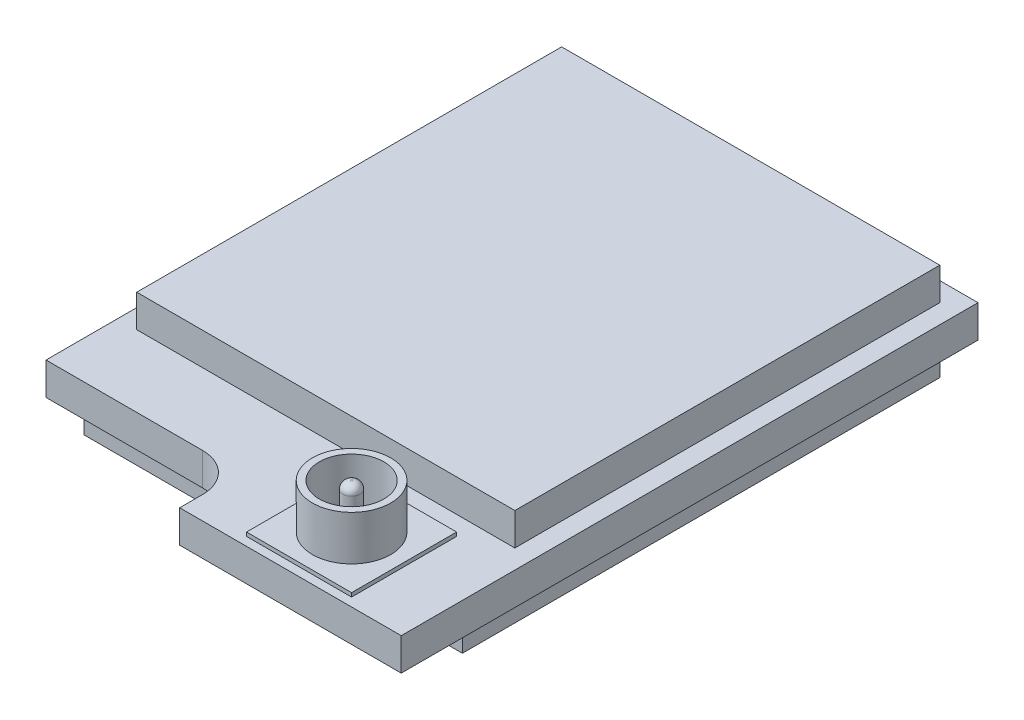
ISO-10303-21;
HEADER;
FILE_DESCRIPTION(('STEP AP214'),'2;1');
FILE_NAME('part.step','',(''),(''),'','','');
FILE_SCHEMA(('AUTOMOTIVE_DESIGN { 1 0 10303 214 1 1 1 1 }'));
ENDSEC;
DATA;
#1=APPLICATION_CONTEXT('core data for automotive mechanical design processes');
#2=APPLICATION_PROTOCOL_DEFINITION('international standard','automotive_design',2000,#1);
#3=PRODUCT_CONTEXT('',#1,'mechanical');
#4=PRODUCT('Part','Part','',(#3));
#5=PRODUCT_RELATED_PRODUCT_CATEGORY('part','',(#4));
#6=PRODUCT_DEFINITION_FORMATION('','',#4);
#7=PRODUCT_DEFINITION_CONTEXT('part definition',#1,'design');
#8=PRODUCT_DEFINITION('design','',#6,#7);
#9=PRODUCT_DEFINITION_SHAPE('','',#8);
#10=(LENGTH_UNIT() NAMED_UNIT(*) SI_UNIT(.MILLI.,.METRE.));
#11=(NAMED_UNIT(*) PLANE_ANGLE_UNIT() SI_UNIT($,.RADIAN.));
#12=(NAMED_UNIT(*) SI_UNIT($,.STERADIAN.) SOLID_ANGLE_UNIT());
#13=UNCERTAINTY_MEASURE_WITH_UNIT(LENGTH_MEASURE(1.E-05),#10,'distance_accuracy_value','');
#14=(GEOMETRIC_REPRESENTATION_CONTEXT(3) GLOBAL_UNCERTAINTY_ASSIGNED_CONTEXT((#13)) GLOBAL_UNIT_ASSIGNED_CONTEXT((#10,
#11,#12)) REPRESENTATION_CONTEXT('',''));
#15=CARTESIAN_POINT('',(0.,0.,0.));
#16=DIRECTION('',(0.,0.,1.));
#17=DIRECTION('',(1.,0.,0.));
#18=AXIS2_PLACEMENT_3D('',#15,#16,#17);
#19=CARTESIAN_POINT('',(-1.35,-0.425,7.75));
#20=DIRECTION('',(0.,-1.,0.));
#21=DIRECTION('',(0.,0.,-1.));
#22=AXIS2_PLACEMENT_3D('',#19,#20,#21);
#23=PLANE('',#22);
#24=DIRECTION('',(0.,0.,1.));
#25=VECTOR('',#24,1.);
#26=CARTESIAN_POINT('',(-5.45,-0.425,6.75));
#27=LINE('',#26,#25);
#28=CARTESIAN_POINT('',(-5.45,-0.425,-6.75));
#29=VERTEX_POINT('',#28);
#30=CARTESIAN_POINT('',(-5.45,-0.425,6.75));
#31=VERTEX_POINT('',#30);
#32=EDGE_CURVE('E272',#29,#31,#27,.T.);
#33=ORIENTED_EDGE('',*,*,#32,.F.);
#34=DIRECTION('',(-1.,0.,0.));
#35=VECTOR('',#34,1.);
#36=CARTESIAN_POINT('',(5.45,-0.425,-6.75));
#37=LINE('',#36,#35);
#38=CARTESIAN_POINT('',(5.45,-0.425,-6.75));
#39=VERTEX_POINT('',#38);
#40=EDGE_CURVE('E277',#39,#29,#37,.T.);
#41=ORIENTED_EDGE('',*,*,#40,.F.);
#42=DIRECTION('',(0.,0.,-1.));
#43=VECTOR('',#42,1.);
#44=CARTESIAN_POINT('',(5.45,-0.425,6.75));
#45=LINE('',#44,#43);
#46=CARTESIAN_POINT('',(5.45,-0.425,8.35));
#47=VERTEX_POINT('',#46);
#48=EDGE_CURVE('E301',#47,#39,#45,.T.);
#49=ORIENTED_EDGE('',*,*,#48,.F.);
#50=DIRECTION('',(1.,0.,0.));
#51=VECTOR('',#50,1.);
#52=CARTESIAN_POINT('',(-0.349999999999999,-0.425,8.35));
#53=LINE('',#52,#51);
#54=CARTESIAN_POINT('',(-0.349999999999999,-0.425,8.35));
#55=VERTEX_POINT('',#54);
#56=EDGE_CURVE('E298',#55,#47,#53,.T.);
#57=ORIENTED_EDGE('',*,*,#56,.F.);
#58=DIRECTION('',(0.,0.,1.));
#59=VECTOR('',#58,1.);
#60=CARTESIAN_POINT('',(-0.349999999999999,-0.425,7.75000000000001));
#61=LINE('',#60,#59);
#62=CARTESIAN_POINT('',(-0.349999999999999,-0.425,7.75000000000001));
#63=VERTEX_POINT('',#62);
#64=EDGE_CURVE('E296',#63,#55,#61,.T.);
#65=ORIENTED_EDGE('',*,*,#64,.F.);
#66=CARTESIAN_POINT('',(-1.35,-0.425,7.75));
#67=DIRECTION('',(0.,-1.,0.));
#68=DIRECTION('',(0.,0.,-1.));
#69=AXIS2_PLACEMENT_3D('',#66,#67,#68);
#70=CIRCLE('',#69,1.);
#71=CARTESIAN_POINT('',(-1.35000000000001,-0.425,6.75));
#72=VERTEX_POINT('',#71);
#73=EDGE_CURVE('E294',#72,#63,#70,.T.);
#74=ORIENTED_EDGE('',*,*,#73,.F.);
#75=DIRECTION('',(1.,0.,0.));
#76=VECTOR('',#75,1.);
#77=CARTESIAN_POINT('',(-5.45,-0.425,6.75));
#78=LINE('',#77,#76);
#79=EDGE_CURVE('E292',#31,#72,#78,.T.);
#80=ORIENTED_EDGE('',*,*,#79,.F.);
#81=EDGE_LOOP('',(#33,#41,#49,#57,#65,#74,#80));
#82=FACE_BOUND('',#81,.T.);
#83=DIRECTION('',(1.,0.,0.));
#84=VECTOR('',#83,1.);
#85=CARTESIAN_POINT('',(-1.35,-0.425,6.25));
#86=LINE('',#85,#84);
#87=CARTESIAN_POINT('',(-4.95,-0.425,6.25));
#88=VERTEX_POINT('',#87);
#89=CARTESIAN_POINT('',(4.95,-0.425,6.25));
#90=VERTEX_POINT('',#89);
#91=EDGE_CURVE('E343',#88,#90,#86,.T.);
#92=ORIENTED_EDGE('',*,*,#91,.T.);
#93=DIRECTION('',(0.,0.,-1.));
#94=VECTOR('',#93,1.);
#95=CARTESIAN_POINT('',(4.95,-0.425,7.75));
#96=LINE('',#95,#94);
#97=CARTESIAN_POINT('',(4.95,-0.425,-6.25));
#98=VERTEX_POINT('',#97);
#99=EDGE_CURVE('E346',#90,#98,#96,.T.);
#100=ORIENTED_EDGE('',*,*,#99,.T.);
#101=DIRECTION('',(-1.,0.,0.));
#102=VECTOR('',#101,1.);
#103=CARTESIAN_POINT('',(-1.35,-0.425,-6.25));
#104=LINE('',#103,#102);
#105=CARTESIAN_POINT('',(-4.95,-0.425,-6.25));
#106=VERTEX_POINT('',#105);
#107=EDGE_CURVE('E338',#98,#106,#104,.T.);
#108=ORIENTED_EDGE('',*,*,#107,.T.);
#109=DIRECTION('',(0.,0.,1.));
#110=VECTOR('',#109,1.);
#111=CARTESIAN_POINT('',(-4.95,-0.425,7.75));
#112=LINE('',#111,#110);
#113=EDGE_CURVE('E341',#106,#88,#112,.T.);
#114=ORIENTED_EDGE('',*,*,#113,.T.);
#115=EDGE_LOOP('',(#92,#100,#108,#114));
#116=FACE_BOUND('',#115,.T.);
#117=ADVANCED_FACE('F52',(#82,#116),#23,.T.);
#118=CARTESIAN_POINT('',(-1.35,0.425,7.75));
#119=DIRECTION('',(0.,-1.,0.));
#120=DIRECTION('',(0.,0.,-1.));
#121=AXIS2_PLACEMENT_3D('',#118,#119,#120);
#122=PLANE('',#121);
#123=DIRECTION('',(1.,0.,0.));
#124=VECTOR('',#123,1.);
#125=CARTESIAN_POINT('',(-1.35,0.425,-6.25));
#126=LINE('',#125,#124);
#127=CARTESIAN_POINT('',(-4.95,0.425,-6.25));
#128=VERTEX_POINT('',#127);
#129=CARTESIAN_POINT('',(4.95,0.425,-6.25));
#130=VERTEX_POINT('',#129);
#131=EDGE_CURVE('E60',#128,#130,#126,.T.);
#132=ORIENTED_EDGE('',*,*,#131,.T.);
#133=DIRECTION('',(0.,0.,1.));
#134=VECTOR('',#133,1.);
#135=CARTESIAN_POINT('',(4.95,0.425,7.75));
#136=LINE('',#135,#134);
#137=CARTESIAN_POINT('',(4.95,0.425,4.875));
#138=VERTEX_POINT('',#137);
#139=EDGE_CURVE('E12',#130,#138,#136,.T.);
#140=ORIENTED_EDGE('',*,*,#139,.T.);
#141=DIRECTION('',(-1.,0.,0.));
#142=VECTOR('',#141,1.);
#143=CARTESIAN_POINT('',(-1.35,0.425,4.875));
#144=LINE('',#143,#142);
#145=CARTESIAN_POINT('',(-4.95,0.425,4.875));
#146=VERTEX_POINT('',#145);
#147=EDGE_CURVE('E188',#138,#146,#144,.T.);
#148=ORIENTED_EDGE('',*,*,#147,.T.);
#149=DIRECTION('',(0.,0.,-1.));
#150=VECTOR('',#149,1.);
#151=CARTESIAN_POINT('',(-4.95,0.425,7.75));
#152=LINE('',#151,#150);
#153=EDGE_CURVE('E349',#146,#128,#152,.T.);
#154=ORIENTED_EDGE('',*,*,#153,.T.);
#155=EDGE_LOOP('',(#132,#140,#148,#154));
#156=FACE_BOUND('',#155,.T.);
#157=DIRECTION('',(1.,0.,0.));
#158=VECTOR('',#157,1.);
#159=CARTESIAN_POINT('',(1.175,0.425,8.125));
#160=LINE('',#159,#158);
#161=CARTESIAN_POINT('',(1.175,0.425,8.125));
#162=VERTEX_POINT('',#161);
#163=CARTESIAN_POINT('',(3.925,0.425,8.125));
#164=VERTEX_POINT('',#163);
#165=EDGE_CURVE('E254',#162,#164,#160,.T.);
#166=ORIENTED_EDGE('',*,*,#165,.F.);
#167=DIRECTION('',(0.,0.,1.));
#168=VECTOR('',#167,1.);
#169=CARTESIAN_POINT('',(1.175,0.425,5.375));
#170=LINE('',#169,#168);
#171=CARTESIAN_POINT('',(1.175,0.425,5.375));
#172=VERTEX_POINT('',#171);
#173=EDGE_CURVE('E252',#172,#162,#170,.T.);
#174=ORIENTED_EDGE('',*,*,#173,.F.);
#175=DIRECTION('',(-1.,0.,0.));
#176=VECTOR('',#175,1.);
#177=CARTESIAN_POINT('',(1.175,0.425,5.375));
#178=LINE('',#177,#176);
#179=CARTESIAN_POINT('',(3.925,0.425,5.375));
#180=VERTEX_POINT('',#179);
#181=EDGE_CURVE('E245',#180,#172,#178,.T.);
#182=ORIENTED_EDGE('',*,*,#181,.F.);
#183=DIRECTION('',(0.,0.,-1.));
#184=VECTOR('',#183,1.);
#185=CARTESIAN_POINT('',(3.925,0.425,5.375));
#186=LINE('',#185,#184);
#187=EDGE_CURVE('E257',#164,#180,#186,.T.);
#188=ORIENTED_EDGE('',*,*,#187,.F.);
#189=EDGE_LOOP('',(#166,#174,#182,#188));
#190=FACE_BOUND('',#189,.T.);
#191=DIRECTION('',(0.,0.,1.));
#192=VECTOR('',#191,1.);
#193=CARTESIAN_POINT('',(-5.45,0.425,6.75));
#194=LINE('',#193,#192);
#195=CARTESIAN_POINT('',(-5.45,0.425,-6.75));
#196=VERTEX_POINT('',#195);
#197=CARTESIAN_POINT('',(-5.45,0.425,6.75));
#198=VERTEX_POINT('',#197);
#199=EDGE_CURVE('E273',#196,#198,#194,.T.);
#200=ORIENTED_EDGE('',*,*,#199,.T.);
#201=DIRECTION('',(1.,0.,0.));
#202=VECTOR('',#201,1.);
#203=CARTESIAN_POINT('',(-5.45,0.425,6.75));
#204=LINE('',#203,#202);
#205=CARTESIAN_POINT('',(-1.35000000000001,0.425,6.75));
#206=VERTEX_POINT('',#205);
#207=EDGE_CURVE('E276',#198,#206,#204,.T.);
#208=ORIENTED_EDGE('',*,*,#207,.T.);
#209=CARTESIAN_POINT('',(-1.35,0.425,7.75));
#210=DIRECTION('',(0.,-1.,0.));
#211=DIRECTION('',(0.,0.,-1.));
#212=AXIS2_PLACEMENT_3D('',#209,#210,#211);
#213=CIRCLE('',#212,1.);
#214=CARTESIAN_POINT('',(-0.349999999999999,0.425,7.75000000000001));
#215=VERTEX_POINT('',#214);
#216=EDGE_CURVE('E279',#206,#215,#213,.T.);
#217=ORIENTED_EDGE('',*,*,#216,.T.);
#218=DIRECTION('',(0.,0.,1.));
#219=VECTOR('',#218,1.);
#220=CARTESIAN_POINT('',(-0.349999999999999,0.425,7.75000000000001));
#221=LINE('',#220,#219);
#222=CARTESIAN_POINT('',(-0.349999999999999,0.425,8.35));
#223=VERTEX_POINT('',#222);
#224=EDGE_CURVE('E281',#215,#223,#221,.T.);
#225=ORIENTED_EDGE('',*,*,#224,.T.);
#226=DIRECTION('',(1.,0.,0.));
#227=VECTOR('',#226,1.);
#228=CARTESIAN_POINT('',(-0.349999999999999,0.425,8.35));
#229=LINE('',#228,#227);
#230=CARTESIAN_POINT('',(5.45,0.425,8.35));
#231=VERTEX_POINT('',#230);
#232=EDGE_CURVE('E283',#223,#231,#229,.T.);
#233=ORIENTED_EDGE('',*,*,#232,.T.);
#234=DIRECTION('',(0.,0.,-1.));
#235=VECTOR('',#234,1.);
#236=CARTESIAN_POINT('',(5.45,0.425,8.35));
#237=LINE('',#236,#235);
#238=CARTESIAN_POINT('',(5.45,0.425,-6.75));
#239=VERTEX_POINT('',#238);
#240=EDGE_CURVE('E285',#231,#239,#237,.T.);
#241=ORIENTED_EDGE('',*,*,#240,.T.);
#242=DIRECTION('',(-1.,0.,0.));
#243=VECTOR('',#242,1.);
#244=CARTESIAN_POINT('',(5.45,0.425,-6.75));
#245=LINE('',#244,#243);
#246=EDGE_CURVE('E287',#239,#196,#245,.T.);
#247=ORIENTED_EDGE('',*,*,#246,.T.);
#248=EDGE_LOOP('',(#200,#208,#217,#225,#233,#241,#247));
#249=FACE_BOUND('',#248,.T.);
#250=ADVANCED_FACE('F353',(#156,#190,#249),#122,.F.);
#251=CARTESIAN_POINT('',(-5.45,0.425,6.75));
#252=DIRECTION('',(1.,0.,0.));
#253=DIRECTION('',(0.,0.,-1.));
#254=AXIS2_PLACEMENT_3D('',#251,#252,#253);
#255=PLANE('',#254);
#256=ORIENTED_EDGE('',*,*,#32,.T.);
#257=DIRECTION('',(0.,-1.,0.));
#258=VECTOR('',#257,1.);
#259=CARTESIAN_POINT('',(-5.45,0.425,6.75));
#260=LINE('',#259,#258);
#261=EDGE_CURVE('E321',#198,#31,#260,.T.);
#262=ORIENTED_EDGE('',*,*,#261,.F.);
#263=ORIENTED_EDGE('',*,*,#199,.F.);
#264=DIRECTION('',(0.,-1.,0.));
#265=VECTOR('',#264,1.);
#266=CARTESIAN_POINT('',(-5.45,0.425,-6.75));
#267=LINE('',#266,#265);
#268=EDGE_CURVE('E289',#196,#29,#267,.T.);
#269=ORIENTED_EDGE('',*,*,#268,.T.);
#270=EDGE_LOOP('',(#256,#262,#263,#269));
#271=FACE_BOUND('',#270,.T.);
#272=ADVANCED_FACE('F373',(#271),#255,.F.);
#273=CARTESIAN_POINT('',(-5.45,0.425,6.75));
#274=DIRECTION('',(0.,0.,-1.));
#275=DIRECTION('',(-1.,0.,0.));
#276=AXIS2_PLACEMENT_3D('',#273,#274,#275);
#277=PLANE('',#276);
#278=ORIENTED_EDGE('',*,*,#79,.T.);
#279=DIRECTION('',(0.,-1.,0.));
#280=VECTOR('',#279,1.);
#281=CARTESIAN_POINT('',(-1.35000000000001,0.425,6.75));
#282=LINE('',#281,#280);
#283=EDGE_CURVE('E318',#206,#72,#282,.T.);
#284=ORIENTED_EDGE('',*,*,#283,.F.);
#285=ORIENTED_EDGE('',*,*,#207,.F.);
#286=ORIENTED_EDGE('',*,*,#261,.T.);
#287=EDGE_LOOP('',(#278,#284,#285,#286));
#288=FACE_BOUND('',#287,.T.);
#289=ADVANCED_FACE('F399',(#288),#277,.F.);
#290=CARTESIAN_POINT('',(-1.35,0.425,7.75));
#291=DIRECTION('',(0.,-1.,0.));
#292=DIRECTION('',(0.,0.,-1.));
#293=AXIS2_PLACEMENT_3D('',#290,#291,#292);
#294=CYLINDRICAL_SURFACE('',#293,1.);
#295=ORIENTED_EDGE('',*,*,#73,.T.);
#296=DIRECTION('',(0.,-1.,0.));
#297=VECTOR('',#296,1.);
#298=CARTESIAN_POINT('',(-0.349999999999999,0.425,7.75000000000001));
#299=LINE('',#298,#297);
#300=EDGE_CURVE('E315',#215,#63,#299,.T.);
#301=ORIENTED_EDGE('',*,*,#300,.F.);
#302=ORIENTED_EDGE('',*,*,#216,.F.);
#303=ORIENTED_EDGE('',*,*,#283,.T.);
#304=EDGE_LOOP('',(#295,#301,#302,#303));
#305=FACE_BOUND('',#304,.T.);
#306=ADVANCED_FACE('F395',(#305),#294,.F.);
#307=CARTESIAN_POINT('',(-0.349999999999999,0.425,7.75000000000001));
#308=DIRECTION('',(1.,0.,0.));
#309=DIRECTION('',(0.,0.,-1.));
#310=AXIS2_PLACEMENT_3D('',#307,#308,#309);
#311=PLANE('',#310);
#312=ORIENTED_EDGE('',*,*,#64,.T.);
#313=DIRECTION('',(0.,-1.,0.));
#314=VECTOR('',#313,1.);
#315=CARTESIAN_POINT('',(-0.349999999999999,0.425,8.35));
#316=LINE('',#315,#314);
#317=EDGE_CURVE('E312',#223,#55,#316,.T.);
#318=ORIENTED_EDGE('',*,*,#317,.F.);
#319=ORIENTED_EDGE('',*,*,#224,.F.);
#320=ORIENTED_EDGE('',*,*,#300,.T.);
#321=EDGE_LOOP('',(#312,#318,#319,#320));
#322=FACE_BOUND('',#321,.T.);
#323=ADVANCED_FACE('F391',(#322),#311,.F.);
#324=CARTESIAN_POINT('',(-0.349999999999999,0.425,8.35));
#325=DIRECTION('',(0.,0.,-1.));
#326=DIRECTION('',(-1.,0.,0.));
#327=AXIS2_PLACEMENT_3D('',#324,#325,#326);
#328=PLANE('',#327);
#329=ORIENTED_EDGE('',*,*,#56,.T.);
#330=DIRECTION('',(0.,-1.,0.));
#331=VECTOR('',#330,1.);
#332=CARTESIAN_POINT('',(5.45,0.425,8.35));
#333=LINE('',#332,#331);
#334=EDGE_CURVE('E309',#231,#47,#333,.T.);
#335=ORIENTED_EDGE('',*,*,#334,.F.);
#336=ORIENTED_EDGE('',*,*,#232,.F.);
#337=ORIENTED_EDGE('',*,*,#317,.T.);
#338=EDGE_LOOP('',(#329,#335,#336,#337));
#339=FACE_BOUND('',#338,.T.);
#340=ADVANCED_FACE('F387',(#339),#328,.F.);
#341=CARTESIAN_POINT('',(5.45,0.425,6.75));
#342=DIRECTION('',(-1.,0.,0.));
#343=DIRECTION('',(0.,0.,1.));
#344=AXIS2_PLACEMENT_3D('',#341,#342,#343);
#345=PLANE('',#344);
#346=ORIENTED_EDGE('',*,*,#48,.T.);
#347=DIRECTION('',(0.,-1.,0.));
#348=VECTOR('',#347,1.);
#349=CARTESIAN_POINT('',(5.45,0.425,-6.75));
#350=LINE('',#349,#348);
#351=EDGE_CURVE('E306',#239,#39,#350,.T.);
#352=ORIENTED_EDGE('',*,*,#351,.F.);
#353=ORIENTED_EDGE('',*,*,#240,.F.);
#354=ORIENTED_EDGE('',*,*,#334,.T.);
#355=EDGE_LOOP('',(#346,#352,#353,#354));
#356=FACE_BOUND('',#355,.T.);
#357=ADVANCED_FACE('F383',(#356),#345,.F.);
#358=CARTESIAN_POINT('',(5.45,0.425,-6.75));
#359=DIRECTION('',(0.,0.,1.));
#360=DIRECTION('',(1.,0.,0.));
#361=AXIS2_PLACEMENT_3D('',#358,#359,#360);
#362=PLANE('',#361);
#363=ORIENTED_EDGE('',*,*,#40,.T.);
#364=ORIENTED_EDGE('',*,*,#268,.F.);
#365=ORIENTED_EDGE('',*,*,#246,.F.);
#366=ORIENTED_EDGE('',*,*,#351,.T.);
#367=EDGE_LOOP('',(#363,#364,#365,#366));
#368=FACE_BOUND('',#367,.T.);
#369=ADVANCED_FACE('F379',(#368),#362,.F.);
#370=CARTESIAN_POINT('',(1.175,0.525,5.375));
#371=DIRECTION('',(1.,0.,0.));
#372=DIRECTION('',(0.,0.,-1.));
#373=AXIS2_PLACEMENT_3D('',#370,#371,#372);
#374=PLANE('',#373);
#375=ORIENTED_EDGE('',*,*,#173,.T.);
#376=DIRECTION('',(0.,-1.,0.));
#377=VECTOR('',#376,1.);
#378=CARTESIAN_POINT('',(1.175,0.525,8.125));
#379=LINE('',#378,#377);
#380=CARTESIAN_POINT('',(1.175,0.525,8.125));
#381=VERTEX_POINT('',#380);
#382=EDGE_CURVE('E269',#381,#162,#379,.T.);
#383=ORIENTED_EDGE('',*,*,#382,.F.);
#384=DIRECTION('',(0.,0.,1.));
#385=VECTOR('',#384,1.);
#386=CARTESIAN_POINT('',(1.175,0.525,5.375));
#387=LINE('',#386,#385);
#388=CARTESIAN_POINT('',(1.175,0.525,5.375));
#389=VERTEX_POINT('',#388);
#390=EDGE_CURVE('E241',#389,#381,#387,.T.);
#391=ORIENTED_EDGE('',*,*,#390,.F.);
#392=DIRECTION('',(0.,-1.,0.));
#393=VECTOR('',#392,1.);
#394=CARTESIAN_POINT('',(1.175,0.525,5.375));
#395=LINE('',#394,#393);
#396=EDGE_CURVE('E251',#389,#172,#395,.T.);
#397=ORIENTED_EDGE('',*,*,#396,.T.);
#398=EDGE_LOOP('',(#375,#383,#391,#397));
#399=FACE_BOUND('',#398,.T.);
#400=ADVANCED_FACE('F382',(#399),#374,.F.);
#401=CARTESIAN_POINT('',(1.175,0.525,8.125));
#402=DIRECTION('',(0.,0.,-1.));
#403=DIRECTION('',(-1.,0.,0.));
#404=AXIS2_PLACEMENT_3D('',#401,#402,#403);
#405=PLANE('',#404);
#406=ORIENTED_EDGE('',*,*,#165,.T.);
#407=DIRECTION('',(0.,-1.,0.));
#408=VECTOR('',#407,1.);
#409=CARTESIAN_POINT('',(3.925,0.525,8.125));
#410=LINE('',#409,#408);
#411=CARTESIAN_POINT('',(3.925,0.525,8.125));
#412=VERTEX_POINT('',#411);
#413=EDGE_CURVE('E266',#412,#164,#410,.T.);
#414=ORIENTED_EDGE('',*,*,#413,.F.);
#415=DIRECTION('',(1.,0.,0.));
#416=VECTOR('',#415,1.);
#417=CARTESIAN_POINT('',(1.175,0.525,8.125));
#418=LINE('',#417,#416);
#419=EDGE_CURVE('E244',#381,#412,#418,.T.);
#420=ORIENTED_EDGE('',*,*,#419,.F.);
#421=ORIENTED_EDGE('',*,*,#382,.T.);
#422=EDGE_LOOP('',(#406,#414,#420,#421));
#423=FACE_BOUND('',#422,.T.);
#424=ADVANCED_FACE('F458',(#423),#405,.F.);
#425=CARTESIAN_POINT('',(3.925,0.525,5.375));
#426=DIRECTION('',(-1.,0.,0.));
#427=DIRECTION('',(0.,0.,1.));
#428=AXIS2_PLACEMENT_3D('',#425,#426,#427);
#429=PLANE('',#428);
#430=ORIENTED_EDGE('',*,*,#187,.T.);
#431=DIRECTION('',(0.,-1.,0.));
#432=VECTOR('',#431,1.);
#433=CARTESIAN_POINT('',(3.925,0.525,5.375));
#434=LINE('',#433,#432);
#435=CARTESIAN_POINT('',(3.925,0.525,5.375));
#436=VERTEX_POINT('',#435);
#437=EDGE_CURVE('E263',#436,#180,#434,.T.);
#438=ORIENTED_EDGE('',*,*,#437,.F.);
#439=DIRECTION('',(0.,0.,-1.));
#440=VECTOR('',#439,1.);
#441=CARTESIAN_POINT('',(3.925,0.525,5.375));
#442=LINE('',#441,#440);
#443=EDGE_CURVE('E247',#412,#436,#442,.T.);
#444=ORIENTED_EDGE('',*,*,#443,.F.);
#445=ORIENTED_EDGE('',*,*,#413,.T.);
#446=EDGE_LOOP('',(#430,#438,#444,#445));
#447=FACE_BOUND('',#446,.T.);
#448=ADVANCED_FACE('F466',(#447),#429,.F.);
#449=CARTESIAN_POINT('',(1.175,0.525,5.375));
#450=DIRECTION('',(0.,0.,1.));
#451=DIRECTION('',(1.,0.,0.));
#452=AXIS2_PLACEMENT_3D('',#449,#450,#451);
#453=PLANE('',#452);
#454=ORIENTED_EDGE('',*,*,#181,.T.);
#455=ORIENTED_EDGE('',*,*,#396,.F.);
#456=DIRECTION('',(-1.,0.,0.));
#457=VECTOR('',#456,1.);
#458=CARTESIAN_POINT('',(1.175,0.525,5.375));
#459=LINE('',#458,#457);
#460=EDGE_CURVE('E249',#436,#389,#459,.T.);
#461=ORIENTED_EDGE('',*,*,#460,.F.);
#462=ORIENTED_EDGE('',*,*,#437,.T.);
#463=EDGE_LOOP('',(#454,#455,#461,#462));
#464=FACE_BOUND('',#463,.T.);
#465=ADVANCED_FACE('F474',(#464),#453,.F.);
#466=CARTESIAN_POINT('',(0.,0.525,0.));
#467=DIRECTION('',(0.,1.,0.));
#468=DIRECTION('',(0.,0.,1.));
#469=AXIS2_PLACEMENT_3D('',#466,#467,#468);
#470=PLANE('',#469);
#471=CARTESIAN_POINT('',(2.55,0.525,6.75));
#472=DIRECTION('',(0.,1.,0.));
#473=DIRECTION('',(0.,0.,1.));
#474=AXIS2_PLACEMENT_3D('',#471,#472,#473);
#475=CIRCLE('',#474,1.025);
#476=CARTESIAN_POINT('',(2.55,0.525,7.775));
#477=VERTEX_POINT('',#476);
#478=EDGE_CURVE('E324',#477,#477,#475,.T.);
#479=ORIENTED_EDGE('',*,*,#478,.F.);
#480=EDGE_LOOP('',(#479));
#481=FACE_BOUND('',#480,.T.);
#482=ORIENTED_EDGE('',*,*,#390,.T.);
#483=ORIENTED_EDGE('',*,*,#419,.T.);
#484=ORIENTED_EDGE('',*,*,#443,.T.);
#485=ORIENTED_EDGE('',*,*,#460,.T.);
#486=EDGE_LOOP('',(#482,#483,#484,#485));
#487=FACE_BOUND('',#486,.T.);
#488=ADVANCED_FACE('F482',(#481,#487),#470,.T.);
#489=CARTESIAN_POINT('',(2.55,1.695,6.75));
#490=DIRECTION('',(0.,-1.,0.));
#491=DIRECTION('',(0.,0.,-1.));
#492=AXIS2_PLACEMENT_3D('',#489,#490,#491);
#493=CYLINDRICAL_SURFACE('',#492,1.025);
#494=ORIENTED_EDGE('',*,*,#478,.T.);
#495=EDGE_LOOP('',(#494));
#496=FACE_BOUND('',#495,.T.);
#497=CARTESIAN_POINT('',(2.55,1.695,6.75));
#498=DIRECTION('',(0.,-1.,0.));
#499=DIRECTION('',(0.,0.,-1.));
#500=AXIS2_PLACEMENT_3D('',#497,#498,#499);
#501=CIRCLE('',#500,1.025);
#502=CARTESIAN_POINT('',(2.55,1.695,5.725));
#503=VERTEX_POINT('',#502);
#504=EDGE_CURVE('E237',#503,#503,#501,.T.);
#505=ORIENTED_EDGE('',*,*,#504,.T.);
#506=EDGE_LOOP('',(#505));
#507=FACE_BOUND('',#506,.T.);
#508=ADVANCED_FACE('F490',(#496,#507),#493,.T.);
#509=CARTESIAN_POINT('',(2.55,1.695,6.75));
#510=DIRECTION('',(0.,-1.,0.));
#511=DIRECTION('',(0.,0.,-1.));
#512=AXIS2_PLACEMENT_3D('',#509,#510,#511);
#513=PLANE('',#512);
#514=CARTESIAN_POINT('',(2.55,1.695,6.75));
#515=DIRECTION('',(0.,-1.,0.));
#516=DIRECTION('',(0.,0.,-1.));
#517=AXIS2_PLACEMENT_3D('',#514,#515,#516);
#518=CIRCLE('',#517,0.845);
#519=CARTESIAN_POINT('',(2.55,1.695,5.905));
#520=VERTEX_POINT('',#519);
#521=EDGE_CURVE('E234',#520,#520,#518,.T.);
#522=ORIENTED_EDGE('',*,*,#521,.T.);
#523=EDGE_LOOP('',(#522));
#524=FACE_BOUND('',#523,.T.);
#525=ORIENTED_EDGE('',*,*,#504,.F.);
#526=EDGE_LOOP('',(#525));
#527=FACE_BOUND('',#526,.T.);
#528=ADVANCED_FACE('F499',(#524,#527),#513,.F.);
#529=CARTESIAN_POINT('',(2.55,1.695,6.75));
#530=DIRECTION('',(0.,-1.,0.));
#531=DIRECTION('',(0.,0.,-1.));
#532=AXIS2_PLACEMENT_3D('',#529,#530,#531);
#533=CYLINDRICAL_SURFACE('',#532,0.845);
#534=CARTESIAN_POINT('',(2.55,0.525,6.75));
#535=DIRECTION('',(0.,1.,0.));
#536=DIRECTION('',(0.,0.,1.));
#537=AXIS2_PLACEMENT_3D('',#534,#535,#536);
#538=CIRCLE('',#537,0.845);
#539=CARTESIAN_POINT('',(2.55,0.525,7.595));
#540=VERTEX_POINT('',#539);
#541=EDGE_CURVE('E240',#540,#540,#538,.T.);
#542=ORIENTED_EDGE('',*,*,#541,.F.);
#543=EDGE_LOOP('',(#542));
#544=FACE_BOUND('',#543,.T.);
#545=ORIENTED_EDGE('',*,*,#521,.F.);
#546=EDGE_LOOP('',(#545));
#547=FACE_BOUND('',#546,.T.);
#548=ADVANCED_FACE('F507',(#544,#547),#533,.F.);
#549=CARTESIAN_POINT('',(2.55,0.525,6.75));
#550=DIRECTION('',(0.,1.,0.));
#551=DIRECTION('',(0.,0.,1.));
#552=AXIS2_PLACEMENT_3D('',#549,#550,#551);
#553=CIRCLE('',#552,0.225);
#554=CARTESIAN_POINT('',(2.55,0.525,6.975));
#555=VERTEX_POINT('',#554);
#556=EDGE_CURVE('E329',#555,#555,#553,.T.);
#557=ORIENTED_EDGE('',*,*,#556,.F.);
#558=EDGE_LOOP('',(#557));
#559=FACE_BOUND('',#558,.T.);
#560=ORIENTED_EDGE('',*,*,#541,.T.);
#561=EDGE_LOOP('',(#560));
#562=FACE_BOUND('',#561,.T.);
#563=ADVANCED_FACE('F493',(#559,#562),#470,.T.);
#564=CARTESIAN_POINT('',(2.55,1.695,6.75));
#565=DIRECTION('',(0.,-1.,0.));
#566=DIRECTION('',(0.,0.,-1.));
#567=AXIS2_PLACEMENT_3D('',#564,#565,#566);
#568=CYLINDRICAL_SURFACE('',#567,0.225);
#569=CARTESIAN_POINT('',(2.55,1.495,6.75));
#570=DIRECTION('',(0.,-1.,0.));
#571=DIRECTION('',(0.,0.,-1.));
#572=AXIS2_PLACEMENT_3D('',#569,#570,#571);
#573=CIRCLE('',#572,0.225);
#574=CARTESIAN_POINT('',(2.55,1.495,6.525));
#575=VERTEX_POINT('',#574);
#576=EDGE_CURVE('E332',#575,#575,#573,.T.);
#577=ORIENTED_EDGE('',*,*,#576,.T.);
#578=EDGE_LOOP('',(#577));
#579=FACE_BOUND('',#578,.T.);
#580=ORIENTED_EDGE('',*,*,#556,.T.);
#581=EDGE_LOOP('',(#580));
#582=FACE_BOUND('',#581,.T.);
#583=ADVANCED_FACE('F522',(#579,#582),#568,.T.);
#584=CARTESIAN_POINT('',(2.55,1.695,6.75));
#585=DIRECTION('',(0.,-1.,0.));
#586=DIRECTION('',(0.,0.,-1.));
#587=AXIS2_PLACEMENT_3D('',#584,#585,#586);
#588=PLANE('',#587);
#589=CARTESIAN_POINT('',(2.55,1.695,6.75));
#590=DIRECTION('',(0.,-1.,0.));
#591=DIRECTION('',(0.,0.,-1.));
#592=AXIS2_PLACEMENT_3D('',#589,#590,#591);
#593=CIRCLE('',#592,0.0250000000000002);
#594=CARTESIAN_POINT('',(2.55,1.695,6.725));
#595=VERTEX_POINT('',#594);
#596=EDGE_CURVE('E335',#595,#595,#593,.F.);
#597=ORIENTED_EDGE('',*,*,#596,.T.);
#598=EDGE_LOOP('',(#597));
#599=FACE_BOUND('',#598,.T.);
#600=ADVANCED_FACE('F529',(#599),#588,.F.);
#601=CARTESIAN_POINT('',(2.55,1.495,6.75));
#602=DIRECTION('',(0.,-1.,0.));
#603=DIRECTION('',(0.,0.,-1.));
#604=AXIS2_PLACEMENT_3D('',#601,#602,#603);
#605=DEGENERATE_TOROIDAL_SURFACE('',#604,0.0250000000000002,0.2,.T.);
#606=ORIENTED_EDGE('',*,*,#596,.F.);
#607=EDGE_LOOP('',(#606));
#608=FACE_BOUND('',#607,.T.);
#609=ORIENTED_EDGE('',*,*,#576,.F.);
#610=EDGE_LOOP('',(#609));
#611=FACE_BOUND('',#610,.T.);
#612=ADVANCED_FACE('F54',(#608,#611),#605,.T.);
#613=CARTESIAN_POINT('',(4.95,-1.275,7.75));
#614=DIRECTION('',(-1.,0.,0.));
#615=DIRECTION('',(0.,0.,1.));
#616=AXIS2_PLACEMENT_3D('',#613,#614,#615);
#617=PLANE('',#616);
#618=ORIENTED_EDGE('',*,*,#99,.F.);
#619=DIRECTION('',(0.,1.,0.));
#620=VECTOR('',#619,1.);
#621=CARTESIAN_POINT('',(4.95,-1.275,6.25));
#622=LINE('',#621,#620);
#623=CARTESIAN_POINT('',(4.95,-1.275,6.25));
#624=VERTEX_POINT('',#623);
#625=EDGE_CURVE('E231',#624,#90,#622,.T.);
#626=ORIENTED_EDGE('',*,*,#625,.F.);
#627=DIRECTION('',(0.,0.,1.));
#628=VECTOR('',#627,1.);
#629=CARTESIAN_POINT('',(4.95,-1.275,7.75));
#630=LINE('',#629,#628);
#631=CARTESIAN_POINT('',(4.95,-1.275,-6.25));
#632=VERTEX_POINT('',#631);
#633=EDGE_CURVE('E211',#632,#624,#630,.T.);
#634=ORIENTED_EDGE('',*,*,#633,.F.);
#635=DIRECTION('',(0.,1.,0.));
#636=VECTOR('',#635,1.);
#637=CARTESIAN_POINT('',(4.95,-1.275,-6.25));
#638=LINE('',#637,#636);
#639=EDGE_CURVE('E224',#632,#98,#638,.T.);
#640=ORIENTED_EDGE('',*,*,#639,.T.);
#641=EDGE_LOOP('',(#618,#626,#634,#640));
#642=FACE_BOUND('',#641,.T.);
#643=ADVANCED_FACE('F543',(#642),#617,.F.);
#644=CARTESIAN_POINT('',(-1.35,-1.275,6.25));
#645=DIRECTION('',(0.,0.,-1.));
#646=DIRECTION('',(-1.,0.,0.));
#647=AXIS2_PLACEMENT_3D('',#644,#645,#646);
#648=PLANE('',#647);
#649=ORIENTED_EDGE('',*,*,#91,.F.);
#650=DIRECTION('',(0.,1.,0.));
#651=VECTOR('',#650,1.);
#652=CARTESIAN_POINT('',(-4.95,-1.275,6.25));
#653=LINE('',#652,#651);
#654=CARTESIAN_POINT('',(-4.95,-1.275,6.25));
#655=VERTEX_POINT('',#654);
#656=EDGE_CURVE('E228',#655,#88,#653,.T.);
#657=ORIENTED_EDGE('',*,*,#656,.F.);
#658=DIRECTION('',(-1.,0.,0.));
#659=VECTOR('',#658,1.);
#660=CARTESIAN_POINT('',(-1.35,-1.275,6.25));
#661=LINE('',#660,#659);
#662=EDGE_CURVE('E218',#624,#655,#661,.T.);
#663=ORIENTED_EDGE('',*,*,#662,.F.);
#664=ORIENTED_EDGE('',*,*,#625,.T.);
#665=EDGE_LOOP('',(#649,#657,#663,#664));
#666=FACE_BOUND('',#665,.T.);
#667=ADVANCED_FACE('F550',(#666),#648,.F.);
#668=CARTESIAN_POINT('',(-4.95,-1.275,7.75));
#669=DIRECTION('',(1.,0.,0.));
#670=DIRECTION('',(0.,0.,-1.));
#671=AXIS2_PLACEMENT_3D('',#668,#669,#670);
#672=PLANE('',#671);
#673=ORIENTED_EDGE('',*,*,#113,.F.);
#674=DIRECTION('',(0.,1.,0.));
#675=VECTOR('',#674,1.);
#676=CARTESIAN_POINT('',(-4.95,-1.275,-6.25));
#677=LINE('',#676,#675);
#678=CARTESIAN_POINT('',(-4.95,-1.275,-6.25));
#679=VERTEX_POINT('',#678);
#680=EDGE_CURVE('E75',#679,#106,#677,.T.);
#681=ORIENTED_EDGE('',*,*,#680,.F.);
#682=DIRECTION('',(0.,0.,-1.));
#683=VECTOR('',#682,1.);
#684=CARTESIAN_POINT('',(-4.95,-1.275,7.75));
#685=LINE('',#684,#683);
#686=EDGE_CURVE('E220',#655,#679,#685,.T.);
#687=ORIENTED_EDGE('',*,*,#686,.F.);
#688=ORIENTED_EDGE('',*,*,#656,.T.);
#689=EDGE_LOOP('',(#673,#681,#687,#688));
#690=FACE_BOUND('',#689,.T.);
#691=ADVANCED_FACE('F558',(#690),#672,.F.);
#692=CARTESIAN_POINT('',(-1.35,-1.275,-6.25));
#693=DIRECTION('',(0.,0.,1.));
#694=DIRECTION('',(1.,0.,0.));
#695=AXIS2_PLACEMENT_3D('',#692,#693,#694);
#696=PLANE('',#695);
#697=ORIENTED_EDGE('',*,*,#107,.F.);
#698=ORIENTED_EDGE('',*,*,#639,.F.);
#699=DIRECTION('',(1.,0.,0.));
#700=VECTOR('',#699,1.);
#701=CARTESIAN_POINT('',(-1.35,-1.275,-6.25));
#702=LINE('',#701,#700);
#703=EDGE_CURVE('E222',#679,#632,#702,.T.);
#704=ORIENTED_EDGE('',*,*,#703,.F.);
#705=ORIENTED_EDGE('',*,*,#680,.T.);
#706=EDGE_LOOP('',(#697,#698,#704,#705));
#707=FACE_BOUND('',#706,.T.);
#708=ADVANCED_FACE('F566',(#707),#696,.F.);
#709=CARTESIAN_POINT('',(0.,-1.275,0.));
#710=DIRECTION('',(0.,-1.,0.));
#711=DIRECTION('',(0.,0.,-1.));
#712=AXIS2_PLACEMENT_3D('',#709,#710,#711);
#713=PLANE('',#712);
#714=ORIENTED_EDGE('',*,*,#633,.T.);
#715=ORIENTED_EDGE('',*,*,#662,.T.);
#716=ORIENTED_EDGE('',*,*,#686,.T.);
#717=ORIENTED_EDGE('',*,*,#703,.T.);
#718=EDGE_LOOP('',(#714,#715,#716,#717));
#719=FACE_BOUND('',#718,.T.);
#720=ADVANCED_FACE('F574',(#719),#713,.T.);
#721=CARTESIAN_POINT('',(4.95,1.275,7.75));
#722=DIRECTION('',(1.,0.,0.));
#723=DIRECTION('',(0.,0.,-1.));
#724=AXIS2_PLACEMENT_3D('',#721,#722,#723);
#725=PLANE('',#724);
#726=ORIENTED_EDGE('',*,*,#139,.F.);
#727=DIRECTION('',(0.,-1.,0.));
#728=VECTOR('',#727,1.);
#729=CARTESIAN_POINT('',(4.95,1.275,-6.25));
#730=LINE('',#729,#728);
#731=CARTESIAN_POINT('',(4.95,1.275,-6.25));
#732=VERTEX_POINT('',#731);
#733=EDGE_CURVE('E205',#732,#130,#730,.T.);
#734=ORIENTED_EDGE('',*,*,#733,.F.);
#735=DIRECTION('',(0.,0.,1.));
#736=VECTOR('',#735,1.);
#737=CARTESIAN_POINT('',(4.95,1.275,7.75));
#738=LINE('',#737,#736);
#739=CARTESIAN_POINT('',(4.95,1.275,4.875));
#740=VERTEX_POINT('',#739);
#741=EDGE_CURVE('E198',#732,#740,#738,.T.);
#742=ORIENTED_EDGE('',*,*,#741,.T.);
#743=DIRECTION('',(0.,-1.,0.));
#744=VECTOR('',#743,1.);
#745=CARTESIAN_POINT('',(4.95,1.275,4.875));
#746=LINE('',#745,#744);
#747=EDGE_CURVE('E183',#740,#138,#746,.T.);
#748=ORIENTED_EDGE('',*,*,#747,.T.);
#749=EDGE_LOOP('',(#726,#734,#742,#748));
#750=FACE_BOUND('',#749,.T.);
#751=ADVANCED_FACE('F203',(#750),#725,.T.);
#752=CARTESIAN_POINT('',(-1.35,1.275,-6.25));
#753=DIRECTION('',(0.,0.,-1.));
#754=DIRECTION('',(-1.,0.,0.));
#755=AXIS2_PLACEMENT_3D('',#752,#753,#754);
#756=PLANE('',#755);
#757=ORIENTED_EDGE('',*,*,#131,.F.);
#758=DIRECTION('',(0.,-1.,0.));
#759=VECTOR('',#758,1.);
#760=CARTESIAN_POINT('',(-4.95,1.275,-6.25));
#761=LINE('',#760,#759);
#762=CARTESIAN_POINT('',(-4.95,1.275,-6.25));
#763=VERTEX_POINT('',#762);
#764=EDGE_CURVE('E212',#763,#128,#761,.T.);
#765=ORIENTED_EDGE('',*,*,#764,.F.);
#766=DIRECTION('',(1.,0.,0.));
#767=VECTOR('',#766,1.);
#768=CARTESIAN_POINT('',(-1.35,1.275,-6.25));
#769=LINE('',#768,#767);
#770=EDGE_CURVE('E191',#763,#732,#769,.T.);
#771=ORIENTED_EDGE('',*,*,#770,.T.);
#772=ORIENTED_EDGE('',*,*,#733,.T.);
#773=EDGE_LOOP('',(#757,#765,#771,#772));
#774=FACE_BOUND('',#773,.T.);
#775=ADVANCED_FACE('F356',(#774),#756,.T.);
#776=CARTESIAN_POINT('',(-4.95,1.275,7.75));
#777=DIRECTION('',(-1.,0.,0.));
#778=DIRECTION('',(0.,0.,1.));
#779=AXIS2_PLACEMENT_3D('',#776,#777,#778);
#780=PLANE('',#779);
#781=ORIENTED_EDGE('',*,*,#153,.F.);
#782=DIRECTION('',(0.,-1.,0.));
#783=VECTOR('',#782,1.);
#784=CARTESIAN_POINT('',(-4.95,1.275,4.875));
#785=LINE('',#784,#783);
#786=CARTESIAN_POINT('',(-4.95,1.275,4.875));
#787=VERTEX_POINT('',#786);
#788=EDGE_CURVE('E67',#787,#146,#785,.T.);
#789=ORIENTED_EDGE('',*,*,#788,.F.);
#790=DIRECTION('',(0.,0.,-1.));
#791=VECTOR('',#790,1.);
#792=CARTESIAN_POINT('',(-4.95,1.275,7.75));
#793=LINE('',#792,#791);
#794=EDGE_CURVE('E201',#787,#763,#793,.T.);
#795=ORIENTED_EDGE('',*,*,#794,.T.);
#796=ORIENTED_EDGE('',*,*,#764,.T.);
#797=EDGE_LOOP('',(#781,#789,#795,#796));
#798=FACE_BOUND('',#797,.T.);
#799=ADVANCED_FACE('F358',(#798),#780,.T.);
#800=CARTESIAN_POINT('',(-1.35,1.275,4.875));
#801=DIRECTION('',(0.,0.,1.));
#802=DIRECTION('',(1.,0.,0.));
#803=AXIS2_PLACEMENT_3D('',#800,#801,#802);
#804=PLANE('',#803);
#805=ORIENTED_EDGE('',*,*,#147,.F.);
#806=ORIENTED_EDGE('',*,*,#747,.F.);
#807=DIRECTION('',(-1.,0.,0.));
#808=VECTOR('',#807,1.);
#809=CARTESIAN_POINT('',(-1.35,1.275,4.875));
#810=LINE('',#809,#808);
#811=EDGE_CURVE('E186',#740,#787,#810,.T.);
#812=ORIENTED_EDGE('',*,*,#811,.T.);
#813=ORIENTED_EDGE('',*,*,#788,.T.);
#814=EDGE_LOOP('',(#805,#806,#812,#813));
#815=FACE_BOUND('',#814,.T.);
#816=ADVANCED_FACE('F185',(#815),#804,.T.);
#817=CARTESIAN_POINT('',(0.,1.275,0.));
#818=DIRECTION('',(0.,-1.,0.));
#819=DIRECTION('',(0.,0.,-1.));
#820=AXIS2_PLACEMENT_3D('',#817,#818,#819);
#821=PLANE('',#820);
#822=ORIENTED_EDGE('',*,*,#741,.F.);
#823=ORIENTED_EDGE('',*,*,#770,.F.);
#824=ORIENTED_EDGE('',*,*,#794,.F.);
#825=ORIENTED_EDGE('',*,*,#811,.F.);
#826=EDGE_LOOP('',(#822,#823,#824,#825));
#827=FACE_BOUND('',#826,.T.);
#828=ADVANCED_FACE('F196',(#827),#821,.F.);
#829=CLOSED_SHELL('',(#117,#250,#272,#289,#306,#323,#340,#357,#369,#400,#424,#448,#465,#488,
#508,#528,#548,#563,#583,#600,#612,#643,#667,#691,#708,#720,#751,#775,#799,#816,#828));
#830=MANIFOLD_SOLID_BREP('B2',#829);
#831=ADVANCED_BREP_SHAPE_REPRESENTATION('',(#18,#830),#14);
#832=SHAPE_DEFINITION_REPRESENTATION(#9,#831);
ENDSEC;
END-ISO-10303-21;
